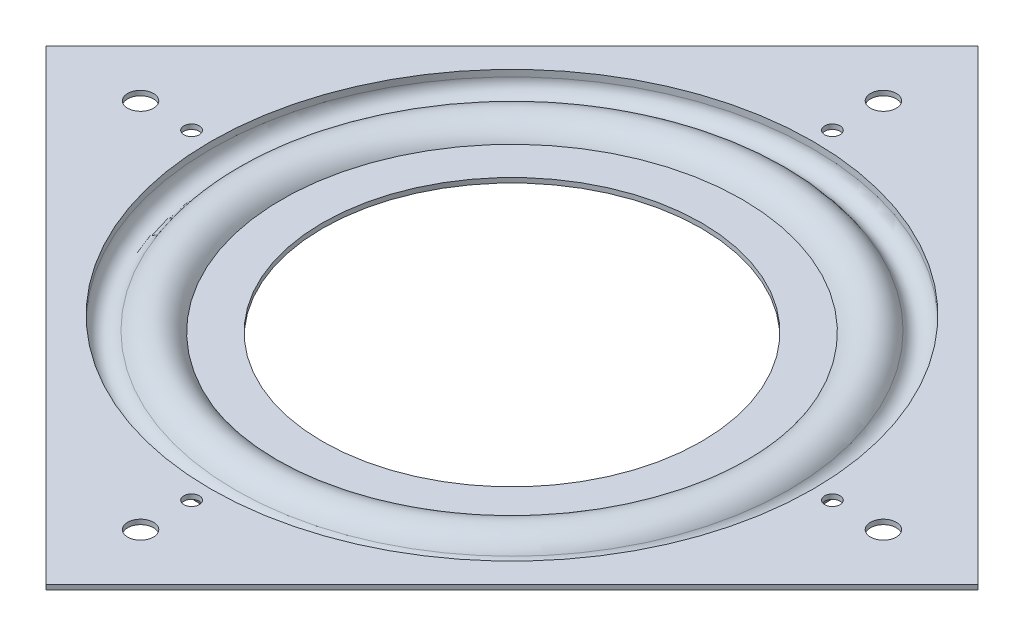
ISO-10303-21;
HEADER;
FILE_DESCRIPTION(('STEP AP214'),'2;1');
FILE_NAME('part.step','',(''),(''),'','','');
FILE_SCHEMA(('AUTOMOTIVE_DESIGN { 1 0 10303 214 1 1 1 1 }'));
ENDSEC;
DATA;
#1=APPLICATION_CONTEXT('core data for automotive mechanical design processes');
#2=APPLICATION_PROTOCOL_DEFINITION('international standard','automotive_design',2000,#1);
#3=PRODUCT_CONTEXT('',#1,'mechanical');
#4=PRODUCT('Part','Part','',(#3));
#5=PRODUCT_RELATED_PRODUCT_CATEGORY('part','',(#4));
#6=PRODUCT_DEFINITION_FORMATION('','',#4);
#7=PRODUCT_DEFINITION_CONTEXT('part definition',#1,'design');
#8=PRODUCT_DEFINITION('design','',#6,#7);
#9=PRODUCT_DEFINITION_SHAPE('','',#8);
#10=(LENGTH_UNIT() NAMED_UNIT(*) SI_UNIT(.MILLI.,.METRE.));
#11=(NAMED_UNIT(*) PLANE_ANGLE_UNIT() SI_UNIT($,.RADIAN.));
#12=(NAMED_UNIT(*) SI_UNIT($,.STERADIAN.) SOLID_ANGLE_UNIT());
#13=UNCERTAINTY_MEASURE_WITH_UNIT(LENGTH_MEASURE(1.E-05),#10,'distance_accuracy_value','');
#14=(GEOMETRIC_REPRESENTATION_CONTEXT(3) GLOBAL_UNCERTAINTY_ASSIGNED_CONTEXT((#13)) GLOBAL_UNIT_ASSIGNED_CONTEXT((#10,
#11,#12)) REPRESENTATION_CONTEXT('',''));
#15=CARTESIAN_POINT('',(0.,0.,0.));
#16=DIRECTION('',(0.,0.,1.));
#17=DIRECTION('',(1.,0.,0.));
#18=AXIS2_PLACEMENT_3D('',#15,#16,#17);
#19=CARTESIAN_POINT('',(46.4272908614699,2.5654,0.));
#20=DIRECTION('',(0.,1.,0.));
#21=DIRECTION('',(0.,0.,1.));
#22=AXIS2_PLACEMENT_3D('',#19,#20,#21);
#23=PLANE('',#22);
#24=CARTESIAN_POINT('',(0.,2.5654,-49.3914086658803));
#25=DIRECTION('',(0.,1.,0.));
#26=DIRECTION('',(0.,0.,1.));
#27=AXIS2_PLACEMENT_3D('',#24,#25,#26);
#28=CIRCLE('',#27,1.19062499999999);
#29=CARTESIAN_POINT('',(0.,2.5654,-48.2007836658804));
#30=VERTEX_POINT('',#29);
#31=EDGE_CURVE('E147',#30,#30,#28,.T.);
#32=ORIENTED_EDGE('',*,*,#31,.T.);
#33=EDGE_LOOP('',(#32));
#34=FACE_BOUND('',#33,.T.);
#35=CARTESIAN_POINT('',(49.3914086658803,2.5654,0.));
#36=DIRECTION('',(0.,1.,0.));
#37=DIRECTION('',(0.,0.,1.));
#38=AXIS2_PLACEMENT_3D('',#35,#36,#37);
#39=CIRCLE('',#38,1.19062499999999);
#40=CARTESIAN_POINT('',(49.3914086658803,2.5654,1.19062499999999));
#41=VERTEX_POINT('',#40);
#42=EDGE_CURVE('E151',#41,#41,#39,.T.);
#43=ORIENTED_EDGE('',*,*,#42,.T.);
#44=EDGE_LOOP('',(#43));
#45=FACE_BOUND('',#44,.T.);
#46=CARTESIAN_POINT('',(0.,2.5654,49.3914086658803));
#47=DIRECTION('',(0.,1.,0.));
#48=DIRECTION('',(0.,0.,1.));
#49=AXIS2_PLACEMENT_3D('',#46,#47,#48);
#50=CIRCLE('',#49,1.19062499999999);
#51=CARTESIAN_POINT('',(0.,2.5654,50.5820336658803));
#52=VERTEX_POINT('',#51);
#53=EDGE_CURVE('E155',#52,#52,#50,.T.);
#54=ORIENTED_EDGE('',*,*,#53,.T.);
#55=EDGE_LOOP('',(#54));
#56=FACE_BOUND('',#55,.T.);
#57=CARTESIAN_POINT('',(-49.3914086658803,2.5654,0.));
#58=DIRECTION('',(0.,1.,0.));
#59=DIRECTION('',(0.,0.,1.));
#60=AXIS2_PLACEMENT_3D('',#57,#58,#59);
#61=CIRCLE('',#60,1.19062499999999);
#62=CARTESIAN_POINT('',(-49.3914086658803,2.5654,1.19062500000001));
#63=VERTEX_POINT('',#62);
#64=EDGE_CURVE('E159',#63,#63,#61,.T.);
#65=ORIENTED_EDGE('',*,*,#64,.T.);
#66=EDGE_LOOP('',(#65));
#67=FACE_BOUND('',#66,.T.);
#68=CARTESIAN_POINT('',(57.2581130279369,2.5654,0.));
#69=DIRECTION('',(0.,1.,0.));
#70=DIRECTION('',(0.,0.,1.));
#71=AXIS2_PLACEMENT_3D('',#68,#69,#70);
#72=CIRCLE('',#71,1.98437499999999);
#73=CARTESIAN_POINT('',(57.2581130279369,2.5654,1.98437499999999));
#74=VERTEX_POINT('',#73);
#75=EDGE_CURVE('E163',#74,#74,#72,.T.);
#76=ORIENTED_EDGE('',*,*,#75,.T.);
#77=EDGE_LOOP('',(#76));
#78=FACE_BOUND('',#77,.T.);
#79=CARTESIAN_POINT('',(0.,2.5654,-57.2581130279369));
#80=DIRECTION('',(0.,1.,0.));
#81=DIRECTION('',(0.,0.,1.));
#82=AXIS2_PLACEMENT_3D('',#79,#80,#81);
#83=CIRCLE('',#82,1.98437499999999);
#84=CARTESIAN_POINT('',(0.,2.5654,-55.2737380279369));
#85=VERTEX_POINT('',#84);
#86=EDGE_CURVE('E167',#85,#85,#83,.T.);
#87=ORIENTED_EDGE('',*,*,#86,.T.);
#88=EDGE_LOOP('',(#87));
#89=FACE_BOUND('',#88,.T.);
#90=CARTESIAN_POINT('',(-57.2581130279369,2.5654,0.));
#91=DIRECTION('',(0.,1.,0.));
#92=DIRECTION('',(0.,0.,1.));
#93=AXIS2_PLACEMENT_3D('',#90,#91,#92);
#94=CIRCLE('',#93,1.98437499999999);
#95=CARTESIAN_POINT('',(-57.2581130279369,2.5654,1.98437499999999));
#96=VERTEX_POINT('',#95);
#97=EDGE_CURVE('E171',#96,#96,#94,.T.);
#98=ORIENTED_EDGE('',*,*,#97,.T.);
#99=EDGE_LOOP('',(#98));
#100=FACE_BOUND('',#99,.T.);
#101=CARTESIAN_POINT('',(0.,2.5654,57.2581130279369));
#102=DIRECTION('',(0.,1.,0.));
#103=DIRECTION('',(0.,0.,1.));
#104=AXIS2_PLACEMENT_3D('',#101,#102,#103);
#105=CIRCLE('',#104,1.98437499999999);
#106=CARTESIAN_POINT('',(0.,2.5654,59.2424880279369));
#107=VERTEX_POINT('',#106);
#108=EDGE_CURVE('E78',#107,#107,#105,.T.);
#109=ORIENTED_EDGE('',*,*,#108,.T.);
#110=EDGE_LOOP('',(#109));
#111=FACE_BOUND('',#110,.T.);
#112=DIRECTION('',(-0.707106781186547,0.,0.707106781186548));
#113=VECTOR('',#112,1.);
#114=CARTESIAN_POINT('',(71.8420489685532,2.5654,0.));
#115=LINE('',#114,#113);
#116=CARTESIAN_POINT('',(71.8420489685532,2.5654,0.));
#117=VERTEX_POINT('',#116);
#118=CARTESIAN_POINT('',(0.,2.5654,71.8420489685532));
#119=VERTEX_POINT('',#118);
#120=EDGE_CURVE('E47',#117,#119,#115,.T.);
#121=ORIENTED_EDGE('',*,*,#120,.T.);
#122=DIRECTION('',(-0.707106781186548,0.,-0.707106781186548));
#123=VECTOR('',#122,1.);
#124=CARTESIAN_POINT('',(-71.8420489685532,2.5654,0.));
#125=LINE('',#124,#123);
#126=CARTESIAN_POINT('',(-71.8420489685532,2.5654,0.));
#127=VERTEX_POINT('',#126);
#128=EDGE_CURVE('E414',#119,#127,#125,.T.);
#129=ORIENTED_EDGE('',*,*,#128,.T.);
#130=DIRECTION('',(0.707106781186547,0.,-0.707106781186548));
#131=VECTOR('',#130,1.);
#132=CARTESIAN_POINT('',(0.,2.5654,-71.8420489685532));
#133=LINE('',#132,#131);
#134=CARTESIAN_POINT('',(0.,2.5654,-71.8420489685532));
#135=VERTEX_POINT('',#134);
#136=EDGE_CURVE('E103',#127,#135,#133,.T.);
#137=ORIENTED_EDGE('',*,*,#136,.T.);
#138=DIRECTION('',(0.707106781186548,0.,0.707106781186548));
#139=VECTOR('',#138,1.);
#140=CARTESIAN_POINT('',(0.,2.5654,-71.8420489685532));
#141=LINE('',#140,#139);
#142=EDGE_CURVE('E92',#135,#117,#141,.T.);
#143=ORIENTED_EDGE('',*,*,#142,.T.);
#144=EDGE_LOOP('',(#121,#129,#137,#143));
#145=FACE_BOUND('',#144,.T.);
#146=CARTESIAN_POINT('',(0.,2.56540000000001,0.));
#147=DIRECTION('',(0.,1.,0.));
#148=DIRECTION('',(0.,0.,1.));
#149=AXIS2_PLACEMENT_3D('',#146,#147,#148);
#150=CIRCLE('',#149,47.1638908614699);
#151=CARTESIAN_POINT('',(0.,2.56540000000001,47.1638908614699));
#152=VERTEX_POINT('',#151);
#153=EDGE_CURVE('E99',#152,#152,#150,.T.);
#154=ORIENTED_EDGE('',*,*,#153,.T.);
#155=EDGE_LOOP('',(#154));
#156=FACE_BOUND('',#155,.T.);
#157=ADVANCED_FACE('F32',(#34,#45,#56,#67,#78,#89,#100,#111,#145,#156),#23,.F.);
#158=CARTESIAN_POINT('',(46.4272908614699,3.302,0.));
#159=DIRECTION('',(0.,1.,0.));
#160=DIRECTION('',(0.,0.,1.));
#161=AXIS2_PLACEMENT_3D('',#158,#159,#160);
#162=PLANE('',#161);
#163=CARTESIAN_POINT('',(0.,3.30200000000001,-49.3914086658803));
#164=DIRECTION('',(0.,1.,0.));
#165=DIRECTION('',(0.,0.,1.));
#166=AXIS2_PLACEMENT_3D('',#163,#164,#165);
#167=CIRCLE('',#166,1.19062499999999);
#168=CARTESIAN_POINT('',(0.,3.30200000000001,-48.2007836658804));
#169=VERTEX_POINT('',#168);
#170=EDGE_CURVE('E380',#169,#169,#167,.T.);
#171=ORIENTED_EDGE('',*,*,#170,.F.);
#172=EDGE_LOOP('',(#171));
#173=FACE_BOUND('',#172,.T.);
#174=CARTESIAN_POINT('',(49.3914086658803,3.30200000000001,0.));
#175=DIRECTION('',(0.,1.,0.));
#176=DIRECTION('',(0.,0.,1.));
#177=AXIS2_PLACEMENT_3D('',#174,#175,#176);
#178=CIRCLE('',#177,1.19062499999999);
#179=CARTESIAN_POINT('',(49.3914086658803,3.30200000000001,1.19062499999998));
#180=VERTEX_POINT('',#179);
#181=EDGE_CURVE('E382',#180,#180,#178,.T.);
#182=ORIENTED_EDGE('',*,*,#181,.F.);
#183=EDGE_LOOP('',(#182));
#184=FACE_BOUND('',#183,.T.);
#185=CARTESIAN_POINT('',(0.,3.30200000000001,49.3914086658803));
#186=DIRECTION('',(0.,1.,0.));
#187=DIRECTION('',(0.,0.,1.));
#188=AXIS2_PLACEMENT_3D('',#185,#186,#187);
#189=CIRCLE('',#188,1.19062499999999);
#190=CARTESIAN_POINT('',(0.,3.30200000000001,50.5820336658803));
#191=VERTEX_POINT('',#190);
#192=EDGE_CURVE('E388',#191,#191,#189,.T.);
#193=ORIENTED_EDGE('',*,*,#192,.F.);
#194=EDGE_LOOP('',(#193));
#195=FACE_BOUND('',#194,.T.);
#196=CARTESIAN_POINT('',(-49.3914086658803,3.30200000000001,0.));
#197=DIRECTION('',(0.,1.,0.));
#198=DIRECTION('',(0.,0.,1.));
#199=AXIS2_PLACEMENT_3D('',#196,#197,#198);
#200=CIRCLE('',#199,1.19062499999999);
#201=CARTESIAN_POINT('',(-49.3914086658803,3.30200000000001,1.190625));
#202=VERTEX_POINT('',#201);
#203=EDGE_CURVE('E392',#202,#202,#200,.T.);
#204=ORIENTED_EDGE('',*,*,#203,.F.);
#205=EDGE_LOOP('',(#204));
#206=FACE_BOUND('',#205,.T.);
#207=CARTESIAN_POINT('',(57.2581130279369,3.30200000000001,0.));
#208=DIRECTION('',(0.,1.,0.));
#209=DIRECTION('',(0.,0.,1.));
#210=AXIS2_PLACEMENT_3D('',#207,#208,#209);
#211=CIRCLE('',#210,1.98437499999999);
#212=CARTESIAN_POINT('',(57.2581130279369,3.30200000000001,1.98437499999999));
#213=VERTEX_POINT('',#212);
#214=EDGE_CURVE('E396',#213,#213,#211,.T.);
#215=ORIENTED_EDGE('',*,*,#214,.F.);
#216=EDGE_LOOP('',(#215));
#217=FACE_BOUND('',#216,.T.);
#218=CARTESIAN_POINT('',(0.,3.30200000000001,-57.2581130279369));
#219=DIRECTION('',(0.,1.,0.));
#220=DIRECTION('',(0.,0.,1.));
#221=AXIS2_PLACEMENT_3D('',#218,#219,#220);
#222=CIRCLE('',#221,1.98437499999999);
#223=CARTESIAN_POINT('',(0.,3.30200000000001,-55.2737380279369));
#224=VERTEX_POINT('',#223);
#225=EDGE_CURVE('E400',#224,#224,#222,.T.);
#226=ORIENTED_EDGE('',*,*,#225,.F.);
#227=EDGE_LOOP('',(#226));
#228=FACE_BOUND('',#227,.T.);
#229=CARTESIAN_POINT('',(-57.2581130279369,3.30200000000001,0.));
#230=DIRECTION('',(0.,1.,0.));
#231=DIRECTION('',(0.,0.,1.));
#232=AXIS2_PLACEMENT_3D('',#229,#230,#231);
#233=CIRCLE('',#232,1.98437499999999);
#234=CARTESIAN_POINT('',(-57.2581130279369,3.30200000000001,1.98437499999999));
#235=VERTEX_POINT('',#234);
#236=EDGE_CURVE('E404',#235,#235,#233,.T.);
#237=ORIENTED_EDGE('',*,*,#236,.F.);
#238=EDGE_LOOP('',(#237));
#239=FACE_BOUND('',#238,.T.);
#240=CARTESIAN_POINT('',(0.,3.30200000000001,57.2581130279369));
#241=DIRECTION('',(0.,1.,0.));
#242=DIRECTION('',(0.,0.,1.));
#243=AXIS2_PLACEMENT_3D('',#240,#241,#242);
#244=CIRCLE('',#243,1.98437499999999);
#245=CARTESIAN_POINT('',(0.,3.30200000000001,59.2424880279369));
#246=VERTEX_POINT('',#245);
#247=EDGE_CURVE('E408',#246,#246,#244,.T.);
#248=ORIENTED_EDGE('',*,*,#247,.F.);
#249=EDGE_LOOP('',(#248));
#250=FACE_BOUND('',#249,.T.);
#251=DIRECTION('',(-0.707106781186548,0.,-0.707106781186548));
#252=VECTOR('',#251,1.);
#253=CARTESIAN_POINT('',(0.,3.302,-71.8420489685532));
#254=LINE('',#253,#252);
#255=CARTESIAN_POINT('',(71.8420489685532,3.302,0.));
#256=VERTEX_POINT('',#255);
#257=CARTESIAN_POINT('',(0.,3.302,-71.8420489685532));
#258=VERTEX_POINT('',#257);
#259=EDGE_CURVE('E66',#256,#258,#254,.T.);
#260=ORIENTED_EDGE('',*,*,#259,.T.);
#261=DIRECTION('',(-0.707106781186547,0.,0.707106781186548));
#262=VECTOR('',#261,1.);
#263=CARTESIAN_POINT('',(0.,3.302,-71.8420489685532));
#264=LINE('',#263,#262);
#265=CARTESIAN_POINT('',(-71.8420489685532,3.302,0.));
#266=VERTEX_POINT('',#265);
#267=EDGE_CURVE('E70',#258,#266,#264,.T.);
#268=ORIENTED_EDGE('',*,*,#267,.T.);
#269=DIRECTION('',(0.707106781186548,0.,0.707106781186548));
#270=VECTOR('',#269,1.);
#271=CARTESIAN_POINT('',(-71.8420489685532,3.302,0.));
#272=LINE('',#271,#270);
#273=CARTESIAN_POINT('',(0.,3.302,71.8420489685532));
#274=VERTEX_POINT('',#273);
#275=EDGE_CURVE('E88',#266,#274,#272,.T.);
#276=ORIENTED_EDGE('',*,*,#275,.T.);
#277=DIRECTION('',(0.707106781186547,0.,-0.707106781186548));
#278=VECTOR('',#277,1.);
#279=CARTESIAN_POINT('',(71.8420489685532,3.302,0.));
#280=LINE('',#279,#278);
#281=EDGE_CURVE('E73',#274,#256,#280,.T.);
#282=ORIENTED_EDGE('',*,*,#281,.T.);
#283=EDGE_LOOP('',(#260,#268,#276,#282));
#284=FACE_BOUND('',#283,.T.);
#285=CARTESIAN_POINT('',(0.,3.30200000000001,0.));
#286=DIRECTION('',(0.,1.,0.));
#287=DIRECTION('',(0.,0.,1.));
#288=AXIS2_PLACEMENT_3D('',#285,#286,#287);
#289=CIRCLE('',#288,46.4272908614699);
#290=CARTESIAN_POINT('',(0.,3.30200000000001,46.4272908614699));
#291=VERTEX_POINT('',#290);
#292=EDGE_CURVE('E11',#291,#291,#289,.T.);
#293=ORIENTED_EDGE('',*,*,#292,.F.);
#294=EDGE_LOOP('',(#293));
#295=FACE_BOUND('',#294,.T.);
#296=ADVANCED_FACE('F68',(#173,#184,#195,#206,#217,#228,#239,#250,#284,#295),#162,.T.);
#297=CARTESIAN_POINT('',(0.,21.7127262600922,0.));
#298=DIRECTION('',(0.,1.,0.));
#299=DIRECTION('',(0.,0.,1.));
#300=AXIS2_PLACEMENT_3D('',#297,#298,#299);
#301=CYLINDRICAL_SURFACE('',#300,46.4272908614699);
#302=ORIENTED_EDGE('',*,*,#292,.T.);
#303=EDGE_LOOP('',(#302));
#304=FACE_BOUND('',#303,.T.);
#305=CARTESIAN_POINT('',(0.,2.28600000000002,0.));
#306=DIRECTION('',(0.,1.,0.));
#307=DIRECTION('',(0.,0.,1.));
#308=AXIS2_PLACEMENT_3D('',#305,#306,#307);
#309=CIRCLE('',#308,46.4272908614699);
#310=CARTESIAN_POINT('',(0.,2.28600000000002,46.4272908614699));
#311=VERTEX_POINT('',#310);
#312=EDGE_CURVE('E40',#311,#311,#309,.T.);
#313=ORIENTED_EDGE('',*,*,#312,.F.);
#314=EDGE_LOOP('',(#313));
#315=FACE_BOUND('',#314,.T.);
#316=ADVANCED_FACE('F129',(#304,#315),#301,.F.);
#317=CARTESIAN_POINT('',(0.,2.28600000000002,0.));
#318=DIRECTION('',(0.,1.,0.));
#319=DIRECTION('',(0.,0.,1.));
#320=AXIS2_PLACEMENT_3D('',#317,#318,#319);
#321=TOROIDAL_SURFACE('',#320,44.3952908614699,2.032);
#322=ORIENTED_EDGE('',*,*,#312,.T.);
#323=EDGE_LOOP('',(#322));
#324=FACE_BOUND('',#323,.T.);
#325=CARTESIAN_POINT('',(0.,1.27000000000001,0.));
#326=DIRECTION('',(0.,1.,0.));
#327=DIRECTION('',(0.,0.,1.));
#328=AXIS2_PLACEMENT_3D('',#325,#326,#327);
#329=CIRCLE('',#328,42.63552724098);
#330=CARTESIAN_POINT('',(0.,1.27000000000001,42.63552724098));
#331=VERTEX_POINT('',#330);
#332=EDGE_CURVE('E121',#331,#331,#329,.T.);
#333=ORIENTED_EDGE('',*,*,#332,.F.);
#334=EDGE_LOOP('',(#333));
#335=FACE_BOUND('',#334,.T.);
#336=ADVANCED_FACE('F126',(#324,#335),#321,.F.);
#337=CARTESIAN_POINT('',(0.,-0.761999999999995,0.));
#338=DIRECTION('',(0.,1.,0.));
#339=DIRECTION('',(0.,0.,1.));
#340=AXIS2_PLACEMENT_3D('',#337,#338,#339);
#341=TOROIDAL_SURFACE('',#340,39.116,4.064);
#342=ORIENTED_EDGE('',*,*,#332,.T.);
#343=EDGE_LOOP('',(#342));
#344=FACE_BOUND('',#343,.T.);
#345=CARTESIAN_POINT('',(0.,1.0414,0.));
#346=DIRECTION('',(0.,1.,0.));
#347=DIRECTION('',(0.,0.,1.));
#348=AXIS2_PLACEMENT_3D('',#345,#346,#347);
#349=CIRCLE('',#348,35.4740438717634);
#350=CARTESIAN_POINT('',(0.,1.0414,35.4740438717634));
#351=VERTEX_POINT('',#350);
#352=EDGE_CURVE('E118',#351,#351,#349,.T.);
#353=ORIENTED_EDGE('',*,*,#352,.F.);
#354=EDGE_LOOP('',(#353));
#355=FACE_BOUND('',#354,.T.);
#356=ADVANCED_FACE('F137',(#344,#355),#341,.T.);
#357=CARTESIAN_POINT('',(29.21,1.0414,0.));
#358=DIRECTION('',(0.,1.,0.));
#359=DIRECTION('',(0.,0.,1.));
#360=AXIS2_PLACEMENT_3D('',#357,#358,#359);
#361=PLANE('',#360);
#362=ORIENTED_EDGE('',*,*,#352,.T.);
#363=EDGE_LOOP('',(#362));
#364=FACE_BOUND('',#363,.T.);
#365=CARTESIAN_POINT('',(0.,1.0414,0.));
#366=DIRECTION('',(0.,1.,0.));
#367=DIRECTION('',(0.,0.,1.));
#368=AXIS2_PLACEMENT_3D('',#365,#366,#367);
#369=CIRCLE('',#368,29.21);
#370=CARTESIAN_POINT('',(0.,1.0414,29.21));
#371=VERTEX_POINT('',#370);
#372=EDGE_CURVE('E115',#371,#371,#369,.T.);
#373=ORIENTED_EDGE('',*,*,#372,.F.);
#374=EDGE_LOOP('',(#373));
#375=FACE_BOUND('',#374,.T.);
#376=ADVANCED_FACE('F203',(#364,#375),#361,.T.);
#377=CARTESIAN_POINT('',(0.,21.7127262600922,0.));
#378=DIRECTION('',(0.,1.,0.));
#379=DIRECTION('',(0.,0.,1.));
#380=AXIS2_PLACEMENT_3D('',#377,#378,#379);
#381=CYLINDRICAL_SURFACE('',#380,29.21);
#382=ORIENTED_EDGE('',*,*,#372,.T.);
#383=EDGE_LOOP('',(#382));
#384=FACE_BOUND('',#383,.T.);
#385=CARTESIAN_POINT('',(0.,0.304800000000001,0.));
#386=DIRECTION('',(0.,1.,0.));
#387=DIRECTION('',(0.,0.,1.));
#388=AXIS2_PLACEMENT_3D('',#385,#386,#387);
#389=CIRCLE('',#388,29.21);
#390=CARTESIAN_POINT('',(0.,0.304800000000001,29.21));
#391=VERTEX_POINT('',#390);
#392=EDGE_CURVE('E112',#391,#391,#389,.T.);
#393=ORIENTED_EDGE('',*,*,#392,.F.);
#394=EDGE_LOOP('',(#393));
#395=FACE_BOUND('',#394,.T.);
#396=ADVANCED_FACE('F198',(#384,#395),#381,.F.);
#397=CARTESIAN_POINT('',(29.21,0.304800000000003,0.));
#398=DIRECTION('',(0.,1.,0.));
#399=DIRECTION('',(0.,0.,1.));
#400=AXIS2_PLACEMENT_3D('',#397,#398,#399);
#401=PLANE('',#400);
#402=CARTESIAN_POINT('',(0.,0.304800000000004,0.));
#403=DIRECTION('',(0.,1.,0.));
#404=DIRECTION('',(0.,0.,1.));
#405=AXIS2_PLACEMENT_3D('',#402,#403,#404);
#406=CIRCLE('',#405,35.9642499274213);
#407=CARTESIAN_POINT('',(0.,0.304800000000004,35.9642499274213));
#408=VERTEX_POINT('',#407);
#409=EDGE_CURVE('E109',#408,#408,#406,.T.);
#410=ORIENTED_EDGE('',*,*,#409,.F.);
#411=EDGE_LOOP('',(#410));
#412=FACE_BOUND('',#411,.T.);
#413=ORIENTED_EDGE('',*,*,#392,.T.);
#414=EDGE_LOOP('',(#413));
#415=FACE_BOUND('',#414,.T.);
#416=ADVANCED_FACE('F192',(#412,#415),#401,.F.);
#417=CARTESIAN_POINT('',(0.,-0.761999999999995,0.));
#418=DIRECTION('',(0.,1.,0.));
#419=DIRECTION('',(0.,0.,1.));
#420=AXIS2_PLACEMENT_3D('',#417,#418,#419);
#421=TOROIDAL_SURFACE('',#420,39.116,3.3274);
#422=CARTESIAN_POINT('',(0.,0.901700000000016,0.));
#423=DIRECTION('',(0.,1.,0.));
#424=DIRECTION('',(0.,0.,1.));
#425=AXIS2_PLACEMENT_3D('',#422,#423,#424);
#426=CIRCLE('',#425,41.9976129285523);
#427=CARTESIAN_POINT('',(0.,0.901700000000016,41.9976129285523));
#428=VERTEX_POINT('',#427);
#429=EDGE_CURVE('E106',#428,#428,#426,.T.);
#430=ORIENTED_EDGE('',*,*,#429,.F.);
#431=EDGE_LOOP('',(#430));
#432=FACE_BOUND('',#431,.T.);
#433=ORIENTED_EDGE('',*,*,#409,.T.);
#434=EDGE_LOOP('',(#433));
#435=FACE_BOUND('',#434,.T.);
#436=ADVANCED_FACE('F186',(#432,#435),#421,.F.);
#437=CARTESIAN_POINT('',(0.,2.28600000000002,0.));
#438=DIRECTION('',(0.,1.,0.));
#439=DIRECTION('',(0.,0.,1.));
#440=AXIS2_PLACEMENT_3D('',#437,#438,#439);
#441=TOROIDAL_SURFACE('',#440,44.3952908614699,2.7686);
#442=CARTESIAN_POINT('',(0.,2.28600000000002,0.));
#443=DIRECTION('',(0.,1.,0.));
#444=DIRECTION('',(0.,0.,1.));
#445=AXIS2_PLACEMENT_3D('',#442,#443,#444);
#446=CIRCLE('',#445,47.1638908614699);
#447=CARTESIAN_POINT('',(0.,2.28600000000002,47.1638908614699));
#448=VERTEX_POINT('',#447);
#449=EDGE_CURVE('E102',#448,#448,#446,.T.);
#450=ORIENTED_EDGE('',*,*,#449,.F.);
#451=EDGE_LOOP('',(#450));
#452=FACE_BOUND('',#451,.T.);
#453=ORIENTED_EDGE('',*,*,#429,.T.);
#454=EDGE_LOOP('',(#453));
#455=FACE_BOUND('',#454,.T.);
#456=ADVANCED_FACE('F180',(#452,#455),#441,.T.);
#457=CARTESIAN_POINT('',(0.,21.7127262600922,0.));
#458=DIRECTION('',(0.,1.,0.));
#459=DIRECTION('',(0.,0.,1.));
#460=AXIS2_PLACEMENT_3D('',#457,#458,#459);
#461=CYLINDRICAL_SURFACE('',#460,47.1638908614699);
#462=ORIENTED_EDGE('',*,*,#153,.F.);
#463=EDGE_LOOP('',(#462));
#464=FACE_BOUND('',#463,.T.);
#465=ORIENTED_EDGE('',*,*,#449,.T.);
#466=EDGE_LOOP('',(#465));
#467=FACE_BOUND('',#466,.T.);
#468=ADVANCED_FACE('F177',(#464,#467),#461,.T.);
#469=CARTESIAN_POINT('',(0.,-200.6346,-71.8420489685532));
#470=DIRECTION('',(-0.707106781186548,0.,-0.707106781186547));
#471=DIRECTION('',(-0.707106781186547,0.,0.707106781186548));
#472=AXIS2_PLACEMENT_3D('',#469,#470,#471);
#473=PLANE('',#472);
#474=DIRECTION('',(0.,1.,0.));
#475=VECTOR('',#474,1.);
#476=CARTESIAN_POINT('',(0.,-200.6346,-71.8420489685532));
#477=LINE('',#476,#475);
#478=EDGE_CURVE('E84',#135,#258,#477,.T.);
#479=ORIENTED_EDGE('',*,*,#478,.F.);
#480=ORIENTED_EDGE('',*,*,#136,.F.);
#481=DIRECTION('',(0.,1.,0.));
#482=VECTOR('',#481,1.);
#483=CARTESIAN_POINT('',(-71.8420489685532,-200.6346,0.));
#484=LINE('',#483,#482);
#485=EDGE_CURVE('E86',#127,#266,#484,.T.);
#486=ORIENTED_EDGE('',*,*,#485,.T.);
#487=ORIENTED_EDGE('',*,*,#267,.F.);
#488=EDGE_LOOP('',(#479,#480,#486,#487));
#489=FACE_BOUND('',#488,.T.);
#490=ADVANCED_FACE('F82',(#489),#473,.T.);
#491=CARTESIAN_POINT('',(-71.8420489685532,-200.6346,0.));
#492=DIRECTION('',(-0.707106781186548,0.,0.707106781186548));
#493=DIRECTION('',(0.707106781186548,0.,0.707106781186548));
#494=AXIS2_PLACEMENT_3D('',#491,#492,#493);
#495=PLANE('',#494);
#496=ORIENTED_EDGE('',*,*,#128,.F.);
#497=DIRECTION('',(0.,1.,0.));
#498=VECTOR('',#497,1.);
#499=CARTESIAN_POINT('',(0.,-200.6346,71.8420489685532));
#500=LINE('',#499,#498);
#501=EDGE_CURVE('E94',#119,#274,#500,.T.);
#502=ORIENTED_EDGE('',*,*,#501,.T.);
#503=ORIENTED_EDGE('',*,*,#275,.F.);
#504=ORIENTED_EDGE('',*,*,#485,.F.);
#505=EDGE_LOOP('',(#496,#502,#503,#504));
#506=FACE_BOUND('',#505,.T.);
#507=ADVANCED_FACE('F267',(#506),#495,.T.);
#508=CARTESIAN_POINT('',(71.8420489685532,-200.6346,0.));
#509=DIRECTION('',(0.707106781186548,0.,0.707106781186547));
#510=DIRECTION('',(0.707106781186547,0.,-0.707106781186548));
#511=AXIS2_PLACEMENT_3D('',#508,#509,#510);
#512=PLANE('',#511);
#513=ORIENTED_EDGE('',*,*,#501,.F.);
#514=ORIENTED_EDGE('',*,*,#120,.F.);
#515=DIRECTION('',(0.,1.,0.));
#516=VECTOR('',#515,1.);
#517=CARTESIAN_POINT('',(71.8420489685532,-200.6346,0.));
#518=LINE('',#517,#516);
#519=EDGE_CURVE('E416',#117,#256,#518,.T.);
#520=ORIENTED_EDGE('',*,*,#519,.T.);
#521=ORIENTED_EDGE('',*,*,#281,.F.);
#522=EDGE_LOOP('',(#513,#514,#520,#521));
#523=FACE_BOUND('',#522,.T.);
#524=ADVANCED_FACE('F276',(#523),#512,.T.);
#525=CARTESIAN_POINT('',(0.,-200.6346,-71.8420489685532));
#526=DIRECTION('',(0.707106781186548,0.,-0.707106781186548));
#527=DIRECTION('',(-0.707106781186548,0.,-0.707106781186548));
#528=AXIS2_PLACEMENT_3D('',#525,#526,#527);
#529=PLANE('',#528);
#530=ORIENTED_EDGE('',*,*,#519,.F.);
#531=ORIENTED_EDGE('',*,*,#142,.F.);
#532=ORIENTED_EDGE('',*,*,#478,.T.);
#533=ORIENTED_EDGE('',*,*,#259,.F.);
#534=EDGE_LOOP('',(#530,#531,#532,#533));
#535=FACE_BOUND('',#534,.T.);
#536=ADVANCED_FACE('F91',(#535),#529,.T.);
#537=CARTESIAN_POINT('',(0.,3.302,57.2581130279369));
#538=DIRECTION('',(0.,1.,0.));
#539=DIRECTION('',(0.,0.,1.));
#540=AXIS2_PLACEMENT_3D('',#537,#538,#539);
#541=CYLINDRICAL_SURFACE('',#540,1.98437499999999);
#542=ORIENTED_EDGE('',*,*,#247,.T.);
#543=EDGE_LOOP('',(#542));
#544=FACE_BOUND('',#543,.T.);
#545=ORIENTED_EDGE('',*,*,#108,.F.);
#546=EDGE_LOOP('',(#545));
#547=FACE_BOUND('',#546,.T.);
#548=ADVANCED_FACE('F295',(#544,#547),#541,.F.);
#549=CARTESIAN_POINT('',(-57.2581130279369,3.302,0.));
#550=DIRECTION('',(0.,1.,0.));
#551=DIRECTION('',(0.,0.,1.));
#552=AXIS2_PLACEMENT_3D('',#549,#550,#551);
#553=CYLINDRICAL_SURFACE('',#552,1.98437499999999);
#554=ORIENTED_EDGE('',*,*,#236,.T.);
#555=EDGE_LOOP('',(#554));
#556=FACE_BOUND('',#555,.T.);
#557=ORIENTED_EDGE('',*,*,#97,.F.);
#558=EDGE_LOOP('',(#557));
#559=FACE_BOUND('',#558,.T.);
#560=ADVANCED_FACE('F304',(#556,#559),#553,.F.);
#561=CARTESIAN_POINT('',(0.,3.302,-57.2581130279369));
#562=DIRECTION('',(0.,1.,0.));
#563=DIRECTION('',(0.,0.,1.));
#564=AXIS2_PLACEMENT_3D('',#561,#562,#563);
#565=CYLINDRICAL_SURFACE('',#564,1.98437499999999);
#566=ORIENTED_EDGE('',*,*,#225,.T.);
#567=EDGE_LOOP('',(#566));
#568=FACE_BOUND('',#567,.T.);
#569=ORIENTED_EDGE('',*,*,#86,.F.);
#570=EDGE_LOOP('',(#569));
#571=FACE_BOUND('',#570,.T.);
#572=ADVANCED_FACE('F314',(#568,#571),#565,.F.);
#573=CARTESIAN_POINT('',(57.2581130279369,3.302,0.));
#574=DIRECTION('',(0.,1.,0.));
#575=DIRECTION('',(0.,0.,1.));
#576=AXIS2_PLACEMENT_3D('',#573,#574,#575);
#577=CYLINDRICAL_SURFACE('',#576,1.98437499999999);
#578=ORIENTED_EDGE('',*,*,#214,.T.);
#579=EDGE_LOOP('',(#578));
#580=FACE_BOUND('',#579,.T.);
#581=ORIENTED_EDGE('',*,*,#75,.F.);
#582=EDGE_LOOP('',(#581));
#583=FACE_BOUND('',#582,.T.);
#584=ADVANCED_FACE('F324',(#580,#583),#577,.F.);
#585=CARTESIAN_POINT('',(-49.3914086658803,3.302,0.));
#586=DIRECTION('',(0.,1.,0.));
#587=DIRECTION('',(0.,0.,1.));
#588=AXIS2_PLACEMENT_3D('',#585,#586,#587);
#589=CYLINDRICAL_SURFACE('',#588,1.19062499999999);
#590=ORIENTED_EDGE('',*,*,#64,.F.);
#591=EDGE_LOOP('',(#590));
#592=FACE_BOUND('',#591,.T.);
#593=ORIENTED_EDGE('',*,*,#203,.T.);
#594=EDGE_LOOP('',(#593));
#595=FACE_BOUND('',#594,.T.);
#596=ADVANCED_FACE('F334',(#592,#595),#589,.F.);
#597=CARTESIAN_POINT('',(0.,3.302,49.3914086658803));
#598=DIRECTION('',(0.,1.,0.));
#599=DIRECTION('',(0.,0.,1.));
#600=AXIS2_PLACEMENT_3D('',#597,#598,#599);
#601=CYLINDRICAL_SURFACE('',#600,1.19062499999999);
#602=ORIENTED_EDGE('',*,*,#53,.F.);
#603=EDGE_LOOP('',(#602));
#604=FACE_BOUND('',#603,.T.);
#605=ORIENTED_EDGE('',*,*,#192,.T.);
#606=EDGE_LOOP('',(#605));
#607=FACE_BOUND('',#606,.T.);
#608=ADVANCED_FACE('F344',(#604,#607),#601,.F.);
#609=CARTESIAN_POINT('',(49.3914086658803,3.302,0.));
#610=DIRECTION('',(0.,1.,0.));
#611=DIRECTION('',(0.,0.,1.));
#612=AXIS2_PLACEMENT_3D('',#609,#610,#611);
#613=CYLINDRICAL_SURFACE('',#612,1.19062499999999);
#614=ORIENTED_EDGE('',*,*,#42,.F.);
#615=EDGE_LOOP('',(#614));
#616=FACE_BOUND('',#615,.T.);
#617=ORIENTED_EDGE('',*,*,#181,.T.);
#618=EDGE_LOOP('',(#617));
#619=FACE_BOUND('',#618,.T.);
#620=ADVANCED_FACE('F354',(#616,#619),#613,.F.);
#621=CARTESIAN_POINT('',(0.,3.302,-49.3914086658803));
#622=DIRECTION('',(0.,1.,0.));
#623=DIRECTION('',(0.,0.,1.));
#624=AXIS2_PLACEMENT_3D('',#621,#622,#623);
#625=CYLINDRICAL_SURFACE('',#624,1.19062499999999);
#626=ORIENTED_EDGE('',*,*,#31,.F.);
#627=EDGE_LOOP('',(#626));
#628=FACE_BOUND('',#627,.T.);
#629=ORIENTED_EDGE('',*,*,#170,.T.);
#630=EDGE_LOOP('',(#629));
#631=FACE_BOUND('',#630,.T.);
#632=ADVANCED_FACE('F364',(#628,#631),#625,.F.);
#633=CLOSED_SHELL('',(#157,#296,#316,#336,#356,#376,#396,#416,#436,#456,#468,#490,#507,#524,
#536,#548,#560,#572,#584,#596,#608,#620,#632));
#634=MANIFOLD_SOLID_BREP('B2',#633);
#635=ADVANCED_BREP_SHAPE_REPRESENTATION('',(#18,#634),#14);
#636=SHAPE_DEFINITION_REPRESENTATION(#9,#635);
ENDSEC;
END-ISO-10303-21;
